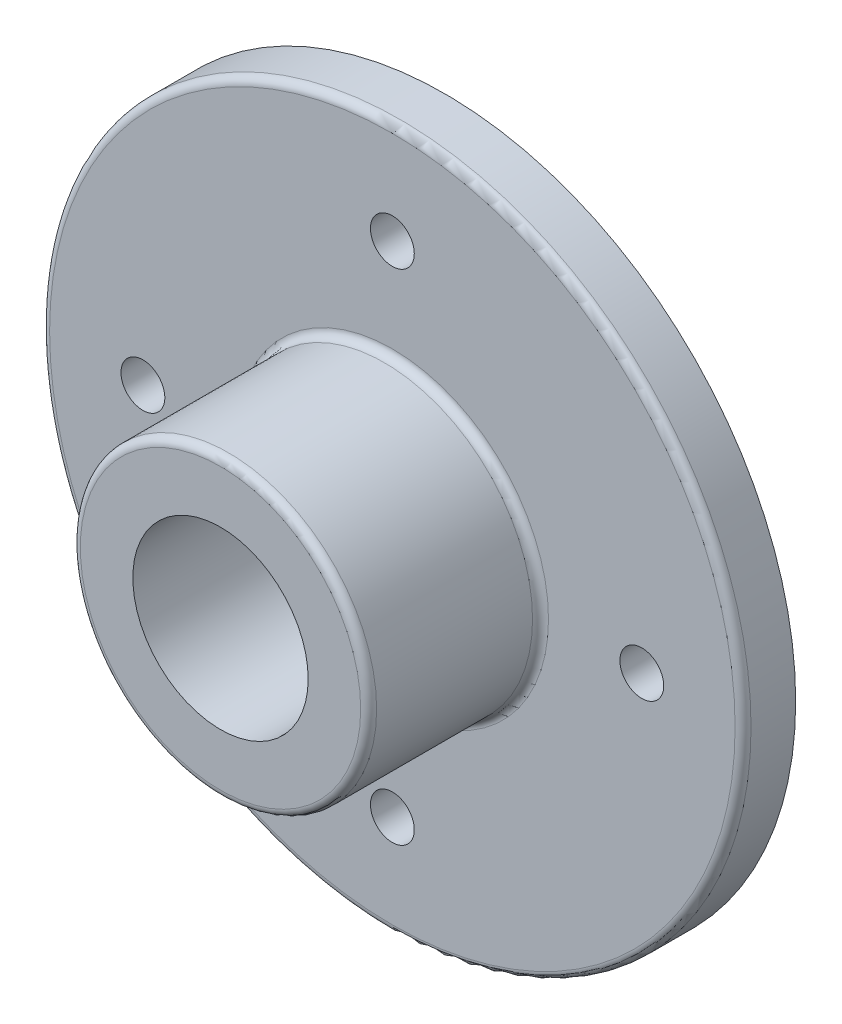
ISO-10303-21;
HEADER;
FILE_DESCRIPTION(('STEP AP214'),'2;1');
FILE_NAME('part.step','',(''),(''),'','','');
FILE_SCHEMA(('AUTOMOTIVE_DESIGN { 1 0 10303 214 1 1 1 1 }'));
ENDSEC;
DATA;
#1=APPLICATION_CONTEXT('core data for automotive mechanical design processes');
#2=APPLICATION_PROTOCOL_DEFINITION('international standard','automotive_design',2000,#1);
#3=PRODUCT_CONTEXT('',#1,'mechanical');
#4=PRODUCT('Part','Part','',(#3));
#5=PRODUCT_RELATED_PRODUCT_CATEGORY('part','',(#4));
#6=PRODUCT_DEFINITION_FORMATION('','',#4);
#7=PRODUCT_DEFINITION_CONTEXT('part definition',#1,'design');
#8=PRODUCT_DEFINITION('design','',#6,#7);
#9=PRODUCT_DEFINITION_SHAPE('','',#8);
#10=(LENGTH_UNIT() NAMED_UNIT(*) SI_UNIT(.MILLI.,.METRE.));
#11=(NAMED_UNIT(*) PLANE_ANGLE_UNIT() SI_UNIT($,.RADIAN.));
#12=(NAMED_UNIT(*) SI_UNIT($,.STERADIAN.) SOLID_ANGLE_UNIT());
#13=UNCERTAINTY_MEASURE_WITH_UNIT(LENGTH_MEASURE(1.E-05),#10,'distance_accuracy_value','');
#14=(GEOMETRIC_REPRESENTATION_CONTEXT(3) GLOBAL_UNCERTAINTY_ASSIGNED_CONTEXT((#13)) GLOBAL_UNIT_ASSIGNED_CONTEXT((#10,
#11,#12)) REPRESENTATION_CONTEXT('',''));
#15=CARTESIAN_POINT('',(0.,0.,0.));
#16=DIRECTION('',(0.,0.,1.));
#17=DIRECTION('',(1.,0.,0.));
#18=AXIS2_PLACEMENT_3D('',#15,#16,#17);
#19=CARTESIAN_POINT('',(0.,0.,7.62));
#20=DIRECTION('',(0.,0.,1.));
#21=DIRECTION('',(1.,0.,0.));
#22=AXIS2_PLACEMENT_3D('',#19,#20,#21);
#23=PLANE('',#22);
#24=CARTESIAN_POINT('',(0.,0.,7.62));
#25=DIRECTION('',(0.,0.,1.));
#26=DIRECTION('',(1.,0.,0.));
#27=AXIS2_PLACEMENT_3D('',#24,#25,#26);
#28=CIRCLE('',#27,22.6175454545454);
#29=CARTESIAN_POINT('',(22.6175454545454,0.,7.62));
#30=VERTEX_POINT('',#29);
#31=EDGE_CURVE('E42',#30,#30,#28,.F.);
#32=ORIENTED_EDGE('',*,*,#31,.T.);
#33=EDGE_LOOP('',(#32));
#34=FACE_BOUND('',#33,.T.);
#35=CARTESIAN_POINT('',(0.,0.,7.62));
#36=DIRECTION('',(0.,0.,1.));
#37=DIRECTION('',(1.,0.,0.));
#38=AXIS2_PLACEMENT_3D('',#35,#36,#37);
#39=CIRCLE('',#38,49.6454545454545);
#40=CARTESIAN_POINT('',(49.6454545454545,0.,7.62));
#41=VERTEX_POINT('',#40);
#42=EDGE_CURVE('E46',#41,#41,#39,.T.);
#43=ORIENTED_EDGE('',*,*,#42,.T.);
#44=EDGE_LOOP('',(#43));
#45=FACE_BOUND('',#44,.T.);
#46=CARTESIAN_POINT('',(36.1315,3.78457373983232E-13,7.62));
#47=DIRECTION('',(0.,0.,1.));
#48=DIRECTION('',(0.,-1.,0.));
#49=AXIS2_PLACEMENT_3D('',#46,#47,#48);
#50=CIRCLE('',#49,3.175);
#51=CARTESIAN_POINT('',(36.1315,-3.17499999999962,7.62));
#52=VERTEX_POINT('',#51);
#53=EDGE_CURVE('E82',#52,#52,#50,.T.);
#54=ORIENTED_EDGE('',*,*,#53,.F.);
#55=EDGE_LOOP('',(#54));
#56=FACE_BOUND('',#55,.T.);
#57=CARTESIAN_POINT('',(2.52304915988821E-13,-36.1315,7.62));
#58=DIRECTION('',(0.,0.,1.));
#59=DIRECTION('',(-1.,0.,0.));
#60=AXIS2_PLACEMENT_3D('',#57,#58,#59);
#61=CIRCLE('',#60,3.175);
#62=CARTESIAN_POINT('',(-3.17499999999975,-36.1315,7.62));
#63=VERTEX_POINT('',#62);
#64=EDGE_CURVE('E76',#63,#63,#61,.T.);
#65=ORIENTED_EDGE('',*,*,#64,.F.);
#66=EDGE_LOOP('',(#65));
#67=FACE_BOUND('',#66,.T.);
#68=CARTESIAN_POINT('',(-36.1315,-1.26152457994411E-13,7.62));
#69=DIRECTION('',(0.,0.,1.));
#70=DIRECTION('',(0.,1.,0.));
#71=AXIS2_PLACEMENT_3D('',#68,#69,#70);
#72=CIRCLE('',#71,3.175);
#73=CARTESIAN_POINT('',(-36.1315,3.17499999999987,7.62));
#74=VERTEX_POINT('',#73);
#75=EDGE_CURVE('E70',#74,#74,#72,.T.);
#76=ORIENTED_EDGE('',*,*,#75,.F.);
#77=EDGE_LOOP('',(#76));
#78=FACE_BOUND('',#77,.T.);
#79=CARTESIAN_POINT('',(0.,36.1315,7.62));
#80=DIRECTION('',(0.,0.,1.));
#81=DIRECTION('',(1.,0.,0.));
#82=AXIS2_PLACEMENT_3D('',#79,#80,#81);
#83=CIRCLE('',#82,3.175);
#84=CARTESIAN_POINT('',(3.175,36.1315,7.62));
#85=VERTEX_POINT('',#84);
#86=EDGE_CURVE('E64',#85,#85,#83,.T.);
#87=ORIENTED_EDGE('',*,*,#86,.F.);
#88=EDGE_LOOP('',(#87));
#89=FACE_BOUND('',#88,.T.);
#90=ADVANCED_FACE('F34',(#34,#45,#56,#67,#78,#89),#23,.T.);
#91=CARTESIAN_POINT('',(0.,0.,7.62));
#92=DIRECTION('',(0.,0.,-1.));
#93=DIRECTION('',(-1.,0.,0.));
#94=AXIS2_PLACEMENT_3D('',#91,#92,#93);
#95=CYLINDRICAL_SURFACE('',#94,50.8);
#96=CARTESIAN_POINT('',(0.,0.,6.46545454545454));
#97=DIRECTION('',(0.,0.,1.));
#98=DIRECTION('',(1.,0.,0.));
#99=AXIS2_PLACEMENT_3D('',#96,#97,#98);
#100=CIRCLE('',#99,50.8);
#101=CARTESIAN_POINT('',(50.8,0.,6.46545454545454));
#102=VERTEX_POINT('',#101);
#103=EDGE_CURVE('E10',#102,#102,#100,.F.);
#104=ORIENTED_EDGE('',*,*,#103,.T.);
#105=EDGE_LOOP('',(#104));
#106=FACE_BOUND('',#105,.T.);
#107=CARTESIAN_POINT('',(0.,0.,0.));
#108=DIRECTION('',(0.,0.,1.));
#109=DIRECTION('',(1.,0.,0.));
#110=AXIS2_PLACEMENT_3D('',#107,#108,#109);
#111=CIRCLE('',#110,50.8);
#112=CARTESIAN_POINT('',(50.8,0.,0.));
#113=VERTEX_POINT('',#112);
#114=EDGE_CURVE('E60',#113,#113,#111,.T.);
#115=ORIENTED_EDGE('',*,*,#114,.T.);
#116=EDGE_LOOP('',(#115));
#117=FACE_BOUND('',#116,.T.);
#118=ADVANCED_FACE('F122',(#106,#117),#95,.T.);
#119=CARTESIAN_POINT('',(0.,0.,0.));
#120=DIRECTION('',(0.,0.,1.));
#121=DIRECTION('',(1.,0.,0.));
#122=AXIS2_PLACEMENT_3D('',#119,#120,#121);
#123=PLANE('',#122);
#124=CARTESIAN_POINT('',(0.,0.,0.));
#125=DIRECTION('',(0.,0.,1.));
#126=DIRECTION('',(1.,0.,0.));
#127=AXIS2_PLACEMENT_3D('',#124,#125,#126);
#128=CIRCLE('',#127,12.7);
#129=CARTESIAN_POINT('',(12.7,0.,0.));
#130=VERTEX_POINT('',#129);
#131=EDGE_CURVE('E85',#130,#130,#128,.T.);
#132=ORIENTED_EDGE('',*,*,#131,.T.);
#133=EDGE_LOOP('',(#132));
#134=FACE_BOUND('',#133,.T.);
#135=CARTESIAN_POINT('',(36.1315,3.78457373983232E-13,0.));
#136=DIRECTION('',(0.,0.,1.));
#137=DIRECTION('',(0.,-1.,0.));
#138=AXIS2_PLACEMENT_3D('',#135,#136,#137);
#139=CIRCLE('',#138,3.175);
#140=CARTESIAN_POINT('',(36.1315,-3.17499999999962,0.));
#141=VERTEX_POINT('',#140);
#142=EDGE_CURVE('E79',#141,#141,#139,.T.);
#143=ORIENTED_EDGE('',*,*,#142,.T.);
#144=EDGE_LOOP('',(#143));
#145=FACE_BOUND('',#144,.T.);
#146=CARTESIAN_POINT('',(2.52304915988821E-13,-36.1315,0.));
#147=DIRECTION('',(0.,0.,1.));
#148=DIRECTION('',(-1.,0.,0.));
#149=AXIS2_PLACEMENT_3D('',#146,#147,#148);
#150=CIRCLE('',#149,3.175);
#151=CARTESIAN_POINT('',(-3.17499999999975,-36.1315,0.));
#152=VERTEX_POINT('',#151);
#153=EDGE_CURVE('E73',#152,#152,#150,.T.);
#154=ORIENTED_EDGE('',*,*,#153,.T.);
#155=EDGE_LOOP('',(#154));
#156=FACE_BOUND('',#155,.T.);
#157=CARTESIAN_POINT('',(-36.1315,-1.26152457994411E-13,0.));
#158=DIRECTION('',(0.,0.,1.));
#159=DIRECTION('',(0.,1.,0.));
#160=AXIS2_PLACEMENT_3D('',#157,#158,#159);
#161=CIRCLE('',#160,3.175);
#162=CARTESIAN_POINT('',(-36.1315,3.17499999999987,0.));
#163=VERTEX_POINT('',#162);
#164=EDGE_CURVE('E67',#163,#163,#161,.T.);
#165=ORIENTED_EDGE('',*,*,#164,.T.);
#166=EDGE_LOOP('',(#165));
#167=FACE_BOUND('',#166,.T.);
#168=CARTESIAN_POINT('',(0.,36.1315,0.));
#169=DIRECTION('',(0.,0.,1.));
#170=DIRECTION('',(1.,0.,0.));
#171=AXIS2_PLACEMENT_3D('',#168,#169,#170);
#172=CIRCLE('',#171,3.175);
#173=CARTESIAN_POINT('',(3.175,36.1315,0.));
#174=VERTEX_POINT('',#173);
#175=EDGE_CURVE('E63',#174,#174,#172,.T.);
#176=ORIENTED_EDGE('',*,*,#175,.T.);
#177=EDGE_LOOP('',(#176));
#178=FACE_BOUND('',#177,.T.);
#179=ORIENTED_EDGE('',*,*,#114,.F.);
#180=EDGE_LOOP('',(#179));
#181=FACE_BOUND('',#180,.T.);
#182=ADVANCED_FACE('F128',(#134,#145,#156,#167,#178,#181),#123,.F.);
#183=CARTESIAN_POINT('',(0.,0.,32.512));
#184=DIRECTION('',(0.,0.,-1.));
#185=DIRECTION('',(-1.,0.,0.));
#186=AXIS2_PLACEMENT_3D('',#183,#184,#185);
#187=CYLINDRICAL_SURFACE('',#186,21.463);
#188=CARTESIAN_POINT('',(0.,0.,31.3574545454545));
#189=DIRECTION('',(0.,0.,1.));
#190=DIRECTION('',(1.,0.,0.));
#191=AXIS2_PLACEMENT_3D('',#188,#189,#190);
#192=CIRCLE('',#191,21.463);
#193=CARTESIAN_POINT('',(21.463,0.,31.3574545454545));
#194=VERTEX_POINT('',#193);
#195=EDGE_CURVE('E51',#194,#194,#192,.F.);
#196=ORIENTED_EDGE('',*,*,#195,.T.);
#197=EDGE_LOOP('',(#196));
#198=FACE_BOUND('',#197,.T.);
#199=CARTESIAN_POINT('',(0.,0.,8.77454545454545));
#200=DIRECTION('',(0.,0.,1.));
#201=DIRECTION('',(1.,0.,0.));
#202=AXIS2_PLACEMENT_3D('',#199,#200,#201);
#203=CIRCLE('',#202,21.463);
#204=CARTESIAN_POINT('',(21.463,0.,8.77454545454545));
#205=VERTEX_POINT('',#204);
#206=EDGE_CURVE('E54',#205,#205,#203,.T.);
#207=ORIENTED_EDGE('',*,*,#206,.T.);
#208=EDGE_LOOP('',(#207));
#209=FACE_BOUND('',#208,.T.);
#210=ADVANCED_FACE('F101',(#198,#209),#187,.T.);
#211=CARTESIAN_POINT('',(0.,0.,32.512));
#212=DIRECTION('',(0.,0.,1.));
#213=DIRECTION('',(1.,0.,0.));
#214=AXIS2_PLACEMENT_3D('',#211,#212,#213);
#215=PLANE('',#214);
#216=CARTESIAN_POINT('',(0.,0.,32.512));
#217=DIRECTION('',(0.,0.,1.));
#218=DIRECTION('',(1.,0.,0.));
#219=AXIS2_PLACEMENT_3D('',#216,#217,#218);
#220=CIRCLE('',#219,12.7);
#221=CARTESIAN_POINT('',(12.7,0.,32.512));
#222=VERTEX_POINT('',#221);
#223=EDGE_CURVE('E38',#222,#222,#220,.T.);
#224=ORIENTED_EDGE('',*,*,#223,.F.);
#225=EDGE_LOOP('',(#224));
#226=FACE_BOUND('',#225,.T.);
#227=CARTESIAN_POINT('',(0.,0.,32.512));
#228=DIRECTION('',(0.,0.,1.));
#229=DIRECTION('',(1.,0.,0.));
#230=AXIS2_PLACEMENT_3D('',#227,#228,#229);
#231=CIRCLE('',#230,20.3084545454545);
#232=CARTESIAN_POINT('',(20.3084545454545,0.,32.512));
#233=VERTEX_POINT('',#232);
#234=EDGE_CURVE('E57',#233,#233,#231,.T.);
#235=ORIENTED_EDGE('',*,*,#234,.T.);
#236=EDGE_LOOP('',(#235));
#237=FACE_BOUND('',#236,.T.);
#238=ADVANCED_FACE('F97',(#226,#237),#215,.T.);
#239=CARTESIAN_POINT('',(0.,36.1315,0.));
#240=DIRECTION('',(0.,0.,1.));
#241=DIRECTION('',(1.,0.,0.));
#242=AXIS2_PLACEMENT_3D('',#239,#240,#241);
#243=CYLINDRICAL_SURFACE('',#242,3.175);
#244=ORIENTED_EDGE('',*,*,#175,.F.);
#245=EDGE_LOOP('',(#244));
#246=FACE_BOUND('',#245,.T.);
#247=ORIENTED_EDGE('',*,*,#86,.T.);
#248=EDGE_LOOP('',(#247));
#249=FACE_BOUND('',#248,.T.);
#250=ADVANCED_FACE('F100',(#246,#249),#243,.F.);
#251=CARTESIAN_POINT('',(-36.1315,-1.26152457994411E-13,0.));
#252=DIRECTION('',(0.,0.,1.));
#253=DIRECTION('',(1.,0.,0.));
#254=AXIS2_PLACEMENT_3D('',#251,#252,#253);
#255=CYLINDRICAL_SURFACE('',#254,3.175);
#256=ORIENTED_EDGE('',*,*,#164,.F.);
#257=EDGE_LOOP('',(#256));
#258=FACE_BOUND('',#257,.T.);
#259=ORIENTED_EDGE('',*,*,#75,.T.);
#260=EDGE_LOOP('',(#259));
#261=FACE_BOUND('',#260,.T.);
#262=ADVANCED_FACE('F151',(#258,#261),#255,.F.);
#263=CARTESIAN_POINT('',(2.52304915988821E-13,-36.1315,0.));
#264=DIRECTION('',(0.,0.,1.));
#265=DIRECTION('',(1.,0.,0.));
#266=AXIS2_PLACEMENT_3D('',#263,#264,#265);
#267=CYLINDRICAL_SURFACE('',#266,3.175);
#268=ORIENTED_EDGE('',*,*,#153,.F.);
#269=EDGE_LOOP('',(#268));
#270=FACE_BOUND('',#269,.T.);
#271=ORIENTED_EDGE('',*,*,#64,.T.);
#272=EDGE_LOOP('',(#271));
#273=FACE_BOUND('',#272,.T.);
#274=ADVANCED_FACE('F116',(#270,#273),#267,.F.);
#275=CARTESIAN_POINT('',(36.1315,3.78457373983232E-13,0.));
#276=DIRECTION('',(0.,0.,1.));
#277=DIRECTION('',(1.,0.,0.));
#278=AXIS2_PLACEMENT_3D('',#275,#276,#277);
#279=CYLINDRICAL_SURFACE('',#278,3.175);
#280=ORIENTED_EDGE('',*,*,#142,.F.);
#281=EDGE_LOOP('',(#280));
#282=FACE_BOUND('',#281,.T.);
#283=ORIENTED_EDGE('',*,*,#53,.T.);
#284=EDGE_LOOP('',(#283));
#285=FACE_BOUND('',#284,.T.);
#286=ADVANCED_FACE('F108',(#282,#285),#279,.F.);
#287=CARTESIAN_POINT('',(0.,0.,31.3574545454545));
#288=DIRECTION('',(0.,0.,1.));
#289=DIRECTION('',(1.,0.,0.));
#290=AXIS2_PLACEMENT_3D('',#287,#288,#289);
#291=TOROIDAL_SURFACE('',#290,20.3084545454545,1.15454545454545);
#292=ORIENTED_EDGE('',*,*,#195,.F.);
#293=EDGE_LOOP('',(#292));
#294=FACE_BOUND('',#293,.T.);
#295=ORIENTED_EDGE('',*,*,#234,.F.);
#296=EDGE_LOOP('',(#295));
#297=FACE_BOUND('',#296,.T.);
#298=ADVANCED_FACE('F105',(#294,#297),#291,.T.);
#299=CARTESIAN_POINT('',(0.,0.,8.77454545454545));
#300=DIRECTION('',(0.,0.,1.));
#301=DIRECTION('',(1.,0.,0.));
#302=AXIS2_PLACEMENT_3D('',#299,#300,#301);
#303=TOROIDAL_SURFACE('',#302,22.6175454545454,1.15454545454545);
#304=ORIENTED_EDGE('',*,*,#31,.F.);
#305=EDGE_LOOP('',(#304));
#306=FACE_BOUND('',#305,.T.);
#307=ORIENTED_EDGE('',*,*,#206,.F.);
#308=EDGE_LOOP('',(#307));
#309=FACE_BOUND('',#308,.T.);
#310=ADVANCED_FACE('F107',(#306,#309),#303,.F.);
#311=CARTESIAN_POINT('',(0.,0.,6.46545454545454));
#312=DIRECTION('',(0.,0.,1.));
#313=DIRECTION('',(1.,0.,0.));
#314=AXIS2_PLACEMENT_3D('',#311,#312,#313);
#315=TOROIDAL_SURFACE('',#314,49.6454545454545,1.15454545454545);
#316=ORIENTED_EDGE('',*,*,#103,.F.);
#317=EDGE_LOOP('',(#316));
#318=FACE_BOUND('',#317,.T.);
#319=ORIENTED_EDGE('',*,*,#42,.F.);
#320=EDGE_LOOP('',(#319));
#321=FACE_BOUND('',#320,.T.);
#322=ADVANCED_FACE('F36',(#318,#321),#315,.T.);
#323=CARTESIAN_POINT('',(0.,0.,-15.5164445310211));
#324=DIRECTION('',(0.,0.,-1.));
#325=DIRECTION('',(-1.,0.,0.));
#326=AXIS2_PLACEMENT_3D('',#323,#324,#325);
#327=CYLINDRICAL_SURFACE('',#326,12.7);
#328=ORIENTED_EDGE('',*,*,#223,.T.);
#329=EDGE_LOOP('',(#328));
#330=FACE_BOUND('',#329,.T.);
#331=ORIENTED_EDGE('',*,*,#131,.F.);
#332=EDGE_LOOP('',(#331));
#333=FACE_BOUND('',#332,.T.);
#334=ADVANCED_FACE('F94',(#330,#333),#327,.F.);
#335=CLOSED_SHELL('',(#90,#118,#182,#210,#238,#250,#262,#274,#286,#298,#310,#322,#334));
#336=MANIFOLD_SOLID_BREP('B2',#335);
#337=ADVANCED_BREP_SHAPE_REPRESENTATION('',(#18,#336),#14);
#338=SHAPE_DEFINITION_REPRESENTATION(#9,#337);
ENDSEC;
END-ISO-10303-21;
